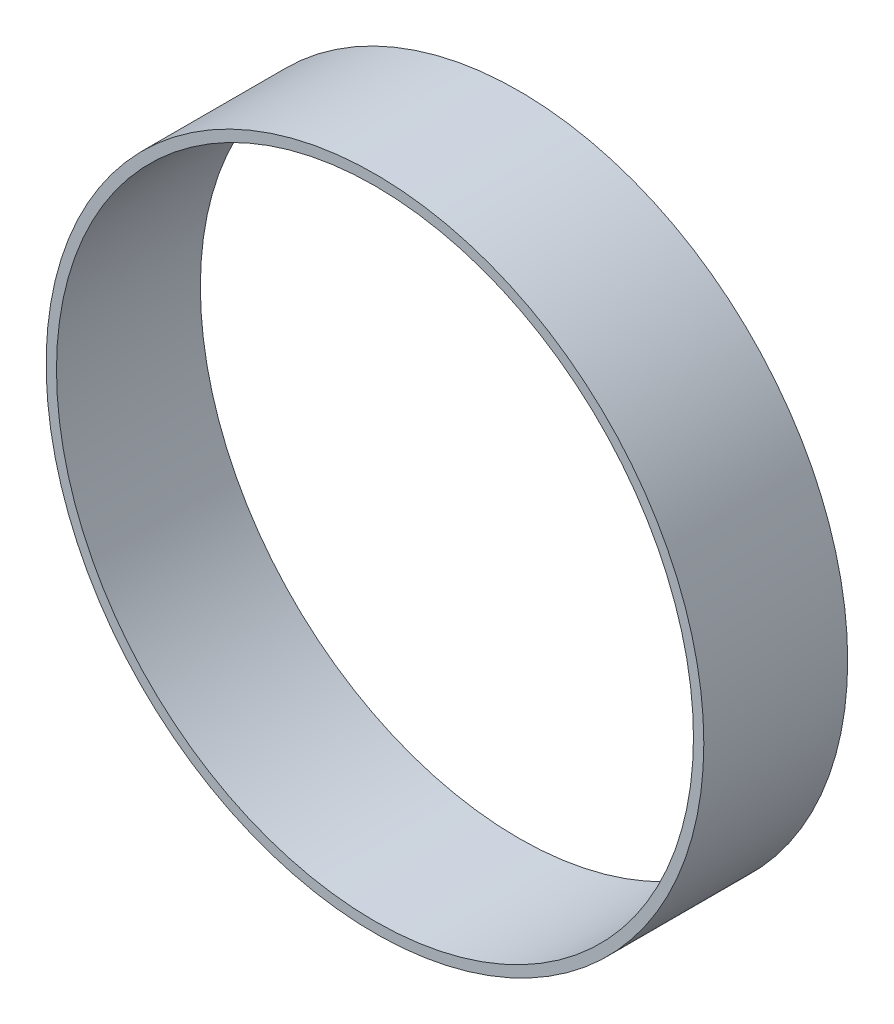
ISO-10303-21;
HEADER;
FILE_DESCRIPTION(('STEP AP214'),'2;1');
FILE_NAME('part.step','',(''),(''),'','','');
FILE_SCHEMA(('AUTOMOTIVE_DESIGN { 1 0 10303 214 1 1 1 1 }'));
ENDSEC;
DATA;
#1=APPLICATION_CONTEXT('core data for automotive mechanical design processes');
#2=APPLICATION_PROTOCOL_DEFINITION('international standard','automotive_design',2000,#1);
#3=PRODUCT_CONTEXT('',#1,'mechanical');
#4=PRODUCT('Part','Part','',(#3));
#5=PRODUCT_RELATED_PRODUCT_CATEGORY('part','',(#4));
#6=PRODUCT_DEFINITION_FORMATION('','',#4);
#7=PRODUCT_DEFINITION_CONTEXT('part definition',#1,'design');
#8=PRODUCT_DEFINITION('design','',#6,#7);
#9=PRODUCT_DEFINITION_SHAPE('','',#8);
#10=(LENGTH_UNIT() NAMED_UNIT(*) SI_UNIT(.MILLI.,.METRE.));
#11=(NAMED_UNIT(*) PLANE_ANGLE_UNIT() SI_UNIT($,.RADIAN.));
#12=(NAMED_UNIT(*) SI_UNIT($,.STERADIAN.) SOLID_ANGLE_UNIT());
#13=UNCERTAINTY_MEASURE_WITH_UNIT(LENGTH_MEASURE(1.E-05),#10,'distance_accuracy_value','');
#14=(GEOMETRIC_REPRESENTATION_CONTEXT(3) GLOBAL_UNCERTAINTY_ASSIGNED_CONTEXT((#13)) GLOBAL_UNIT_ASSIGNED_CONTEXT((#10,
#11,#12)) REPRESENTATION_CONTEXT('',''));
#15=CARTESIAN_POINT('',(0.,0.,0.));
#16=DIRECTION('',(0.,0.,1.));
#17=DIRECTION('',(1.,0.,0.));
#18=AXIS2_PLACEMENT_3D('',#15,#16,#17);
#19=CARTESIAN_POINT('',(0.,0.,328.852236800156));
#20=DIRECTION('',(0.,0.,1.));
#21=DIRECTION('',(1.,0.,0.));
#22=AXIS2_PLACEMENT_3D('',#19,#20,#21);
#23=CYLINDRICAL_SURFACE('',#22,101.6);
#24=CARTESIAN_POINT('',(0.,0.,328.852236800156));
#25=DIRECTION('',(0.,0.,1.));
#26=DIRECTION('',(1.,0.,0.));
#27=AXIS2_PLACEMENT_3D('',#24,#25,#26);
#28=CIRCLE('',#27,101.6);
#29=CARTESIAN_POINT('',(101.6,0.,328.852236800156));
#30=VERTEX_POINT('',#29);
#31=EDGE_CURVE('E10',#30,#30,#28,.T.);
#32=ORIENTED_EDGE('',*,*,#31,.T.);
#33=EDGE_LOOP('',(#32));
#34=FACE_BOUND('',#33,.T.);
#35=CARTESIAN_POINT('',(0.,0.,373.302236800156));
#36=DIRECTION('',(0.,0.,1.));
#37=DIRECTION('',(1.,0.,0.));
#38=AXIS2_PLACEMENT_3D('',#35,#36,#37);
#39=CIRCLE('',#38,101.6);
#40=CARTESIAN_POINT('',(101.6,0.,373.302236800156));
#41=VERTEX_POINT('',#40);
#42=EDGE_CURVE('E32',#41,#41,#39,.T.);
#43=ORIENTED_EDGE('',*,*,#42,.F.);
#44=EDGE_LOOP('',(#43));
#45=FACE_BOUND('',#44,.T.);
#46=ADVANCED_FACE('F29',(#34,#45),#23,.T.);
#47=CARTESIAN_POINT('',(0.,0.,328.852236800156));
#48=DIRECTION('',(0.,0.,1.));
#49=DIRECTION('',(1.,0.,0.));
#50=AXIS2_PLACEMENT_3D('',#47,#48,#49);
#51=PLANE('',#50);
#52=CARTESIAN_POINT('',(0.,0.,328.852236800156));
#53=DIRECTION('',(0.,0.,1.));
#54=DIRECTION('',(1.,0.,0.));
#55=AXIS2_PLACEMENT_3D('',#52,#53,#54);
#56=CIRCLE('',#55,98.3996);
#57=CARTESIAN_POINT('',(98.3996,0.,328.852236800156));
#58=VERTEX_POINT('',#57);
#59=EDGE_CURVE('E39',#58,#58,#56,.T.);
#60=ORIENTED_EDGE('',*,*,#59,.T.);
#61=EDGE_LOOP('',(#60));
#62=FACE_BOUND('',#61,.T.);
#63=ORIENTED_EDGE('',*,*,#31,.F.);
#64=EDGE_LOOP('',(#63));
#65=FACE_BOUND('',#64,.T.);
#66=ADVANCED_FACE('F47',(#62,#65),#51,.F.);
#67=CARTESIAN_POINT('',(0.,0.,373.302236800156));
#68=DIRECTION('',(0.,0.,1.));
#69=DIRECTION('',(1.,0.,0.));
#70=AXIS2_PLACEMENT_3D('',#67,#68,#69);
#71=PLANE('',#70);
#72=CARTESIAN_POINT('',(0.,0.,373.302236800156));
#73=DIRECTION('',(0.,0.,1.));
#74=DIRECTION('',(1.,0.,0.));
#75=AXIS2_PLACEMENT_3D('',#72,#73,#74);
#76=CIRCLE('',#75,98.3996);
#77=CARTESIAN_POINT('',(98.3996,0.,373.302236800156));
#78=VERTEX_POINT('',#77);
#79=EDGE_CURVE('E41',#78,#78,#76,.T.);
#80=ORIENTED_EDGE('',*,*,#79,.F.);
#81=EDGE_LOOP('',(#80));
#82=FACE_BOUND('',#81,.T.);
#83=ORIENTED_EDGE('',*,*,#42,.T.);
#84=EDGE_LOOP('',(#83));
#85=FACE_BOUND('',#84,.T.);
#86=ADVANCED_FACE('F53',(#82,#85),#71,.T.);
#87=CARTESIAN_POINT('',(0.,0.,328.852236800156));
#88=DIRECTION('',(0.,0.,1.));
#89=DIRECTION('',(1.,0.,0.));
#90=AXIS2_PLACEMENT_3D('',#87,#88,#89);
#91=CYLINDRICAL_SURFACE('',#90,98.3996);
#92=ORIENTED_EDGE('',*,*,#59,.F.);
#93=EDGE_LOOP('',(#92));
#94=FACE_BOUND('',#93,.T.);
#95=ORIENTED_EDGE('',*,*,#79,.T.);
#96=EDGE_LOOP('',(#95));
#97=FACE_BOUND('',#96,.T.);
#98=ADVANCED_FACE('F50',(#94,#97),#91,.F.);
#99=CLOSED_SHELL('',(#46,#66,#86,#98));
#100=MANIFOLD_SOLID_BREP('B2',#99);
#101=ADVANCED_BREP_SHAPE_REPRESENTATION('',(#18,#100),#14);
#102=SHAPE_DEFINITION_REPRESENTATION(#9,#101);
ENDSEC;
END-ISO-10303-21;
